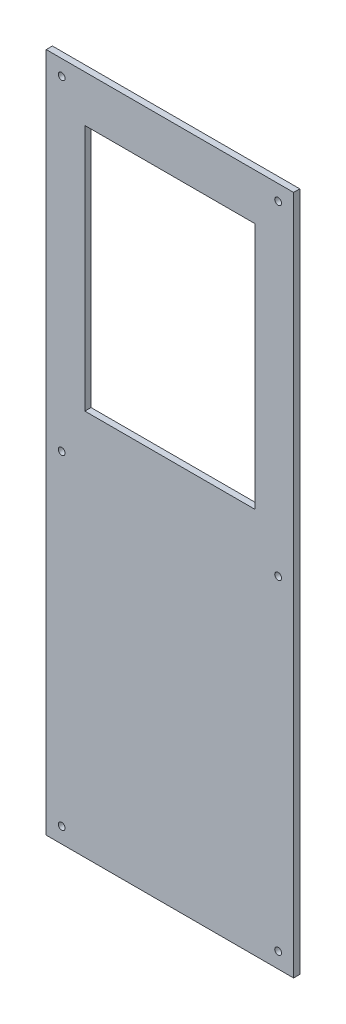
ISO-10303-21;
HEADER;
FILE_DESCRIPTION(('STEP AP214'),'2;1');
FILE_NAME('part.step','',(''),(''),'','','');
FILE_SCHEMA(('AUTOMOTIVE_DESIGN { 1 0 10303 214 1 1 1 1 }'));
ENDSEC;
DATA;
#1=APPLICATION_CONTEXT('core data for automotive mechanical design processes');
#2=APPLICATION_PROTOCOL_DEFINITION('international standard','automotive_design',2000,#1);
#3=PRODUCT_CONTEXT('',#1,'mechanical');
#4=PRODUCT('Part','Part','',(#3));
#5=PRODUCT_RELATED_PRODUCT_CATEGORY('part','',(#4));
#6=PRODUCT_DEFINITION_FORMATION('','',#4);
#7=PRODUCT_DEFINITION_CONTEXT('part definition',#1,'design');
#8=PRODUCT_DEFINITION('design','',#6,#7);
#9=PRODUCT_DEFINITION_SHAPE('','',#8);
#10=(LENGTH_UNIT() NAMED_UNIT(*) SI_UNIT(.MILLI.,.METRE.));
#11=(NAMED_UNIT(*) PLANE_ANGLE_UNIT() SI_UNIT($,.RADIAN.));
#12=(NAMED_UNIT(*) SI_UNIT($,.STERADIAN.) SOLID_ANGLE_UNIT());
#13=UNCERTAINTY_MEASURE_WITH_UNIT(LENGTH_MEASURE(1.E-05),#10,'distance_accuracy_value','');
#14=(GEOMETRIC_REPRESENTATION_CONTEXT(3) GLOBAL_UNCERTAINTY_ASSIGNED_CONTEXT((#13)) GLOBAL_UNIT_ASSIGNED_CONTEXT((#10,
#11,#12)) REPRESENTATION_CONTEXT('',''));
#15=CARTESIAN_POINT('',(0.,0.,0.));
#16=DIRECTION('',(0.,0.,1.));
#17=DIRECTION('',(1.,0.,0.));
#18=AXIS2_PLACEMENT_3D('',#15,#16,#17);
#19=CARTESIAN_POINT('',(0.,0.,4.));
#20=DIRECTION('',(0.,0.,-1.));
#21=DIRECTION('',(-1.,0.,0.));
#22=AXIS2_PLACEMENT_3D('',#19,#20,#21);
#23=PLANE('',#22);
#24=CARTESIAN_POINT('',(-69.9999999999999,-210.,4.));
#25=DIRECTION('',(0.,0.,1.));
#26=DIRECTION('',(-1.,0.,0.));
#27=AXIS2_PLACEMENT_3D('',#24,#25,#26);
#28=CIRCLE('',#27,2.2);
#29=CARTESIAN_POINT('',(-72.1999999999999,-210.,4.));
#30=VERTEX_POINT('',#29);
#31=EDGE_CURVE('E248',#30,#30,#28,.T.);
#32=ORIENTED_EDGE('',*,*,#31,.F.);
#33=EDGE_LOOP('',(#32));
#34=FACE_BOUND('',#33,.T.);
#35=CARTESIAN_POINT('',(-70.,0.,4.));
#36=DIRECTION('',(0.,0.,1.));
#37=DIRECTION('',(-1.,0.,0.));
#38=AXIS2_PLACEMENT_3D('',#35,#36,#37);
#39=CIRCLE('',#38,2.2);
#40=CARTESIAN_POINT('',(-72.1999999999999,0.,4.));
#41=VERTEX_POINT('',#40);
#42=EDGE_CURVE('E247',#41,#41,#39,.T.);
#43=ORIENTED_EDGE('',*,*,#42,.F.);
#44=EDGE_LOOP('',(#43));
#45=FACE_BOUND('',#44,.T.);
#46=CARTESIAN_POINT('',(-70.,210.,4.));
#47=DIRECTION('',(0.,0.,1.));
#48=DIRECTION('',(-1.,0.,0.));
#49=AXIS2_PLACEMENT_3D('',#46,#47,#48);
#50=CIRCLE('',#49,2.2);
#51=CARTESIAN_POINT('',(-72.2,210.,4.));
#52=VERTEX_POINT('',#51);
#53=EDGE_CURVE('E229',#52,#52,#50,.T.);
#54=ORIENTED_EDGE('',*,*,#53,.F.);
#55=EDGE_LOOP('',(#54));
#56=FACE_BOUND('',#55,.T.);
#57=CARTESIAN_POINT('',(70.,-210.,4.));
#58=DIRECTION('',(0.,0.,1.));
#59=DIRECTION('',(1.,0.,0.));
#60=AXIS2_PLACEMENT_3D('',#57,#58,#59);
#61=CIRCLE('',#60,2.2);
#62=CARTESIAN_POINT('',(72.2,-210.,4.));
#63=VERTEX_POINT('',#62);
#64=EDGE_CURVE('E220',#63,#63,#61,.T.);
#65=ORIENTED_EDGE('',*,*,#64,.F.);
#66=EDGE_LOOP('',(#65));
#67=FACE_BOUND('',#66,.T.);
#68=CARTESIAN_POINT('',(70.,210.,4.));
#69=DIRECTION('',(0.,0.,1.));
#70=DIRECTION('',(1.,0.,0.));
#71=AXIS2_PLACEMENT_3D('',#68,#69,#70);
#72=CIRCLE('',#71,2.2);
#73=CARTESIAN_POINT('',(72.2,210.,4.));
#74=VERTEX_POINT('',#73);
#75=EDGE_CURVE('E219',#74,#74,#72,.T.);
#76=ORIENTED_EDGE('',*,*,#75,.F.);
#77=EDGE_LOOP('',(#76));
#78=FACE_BOUND('',#77,.T.);
#79=CARTESIAN_POINT('',(70.,0.,4.));
#80=DIRECTION('',(0.,0.,1.));
#81=DIRECTION('',(1.,0.,0.));
#82=AXIS2_PLACEMENT_3D('',#79,#80,#81);
#83=CIRCLE('',#82,2.2);
#84=CARTESIAN_POINT('',(72.2,0.,4.));
#85=VERTEX_POINT('',#84);
#86=EDGE_CURVE('E159',#85,#85,#83,.T.);
#87=ORIENTED_EDGE('',*,*,#86,.F.);
#88=EDGE_LOOP('',(#87));
#89=FACE_BOUND('',#88,.T.);
#90=DIRECTION('',(0.,-1.,0.));
#91=VECTOR('',#90,1.);
#92=CARTESIAN_POINT('',(-80.,220.,4.));
#93=LINE('',#92,#91);
#94=CARTESIAN_POINT('',(-80.,220.,4.));
#95=VERTEX_POINT('',#94);
#96=CARTESIAN_POINT('',(-79.9999999999999,-220.,4.));
#97=VERTEX_POINT('',#96);
#98=EDGE_CURVE('E168',#95,#97,#93,.T.);
#99=ORIENTED_EDGE('',*,*,#98,.T.);
#100=DIRECTION('',(1.,0.,0.));
#101=VECTOR('',#100,1.);
#102=CARTESIAN_POINT('',(80.,-220.,4.));
#103=LINE('',#102,#101);
#104=CARTESIAN_POINT('',(80.,-220.,4.));
#105=VERTEX_POINT('',#104);
#106=EDGE_CURVE('E199',#97,#105,#103,.T.);
#107=ORIENTED_EDGE('',*,*,#106,.T.);
#108=DIRECTION('',(0.,1.,0.));
#109=VECTOR('',#108,1.);
#110=CARTESIAN_POINT('',(80.,220.,4.));
#111=LINE('',#110,#109);
#112=CARTESIAN_POINT('',(80.,220.,4.));
#113=VERTEX_POINT('',#112);
#114=EDGE_CURVE('E151',#105,#113,#111,.T.);
#115=ORIENTED_EDGE('',*,*,#114,.T.);
#116=DIRECTION('',(-1.,0.,0.));
#117=VECTOR('',#116,1.);
#118=CARTESIAN_POINT('',(80.,220.,4.));
#119=LINE('',#118,#117);
#120=EDGE_CURVE('E146',#113,#95,#119,.T.);
#121=ORIENTED_EDGE('',*,*,#120,.T.);
#122=EDGE_LOOP('',(#99,#107,#115,#121));
#123=FACE_BOUND('',#122,.T.);
#124=DIRECTION('',(0.,1.,0.));
#125=VECTOR('',#124,1.);
#126=CARTESIAN_POINT('',(55.,190.,4.));
#127=LINE('',#126,#125);
#128=CARTESIAN_POINT('',(55.,30.,4.));
#129=VERTEX_POINT('',#128);
#130=CARTESIAN_POINT('',(55.,190.,4.));
#131=VERTEX_POINT('',#130);
#132=EDGE_CURVE('E106',#129,#131,#127,.T.);
#133=ORIENTED_EDGE('',*,*,#132,.F.);
#134=DIRECTION('',(1.,0.,0.));
#135=VECTOR('',#134,1.);
#136=CARTESIAN_POINT('',(-55.,30.,4.));
#137=LINE('',#136,#135);
#138=CARTESIAN_POINT('',(-55.,30.,4.));
#139=VERTEX_POINT('',#138);
#140=EDGE_CURVE('E131',#139,#129,#137,.T.);
#141=ORIENTED_EDGE('',*,*,#140,.F.);
#142=DIRECTION('',(0.,-1.,0.));
#143=VECTOR('',#142,1.);
#144=CARTESIAN_POINT('',(-55.,190.,4.));
#145=LINE('',#144,#143);
#146=CARTESIAN_POINT('',(-55.,190.,4.));
#147=VERTEX_POINT('',#146);
#148=EDGE_CURVE('E128',#147,#139,#145,.T.);
#149=ORIENTED_EDGE('',*,*,#148,.F.);
#150=DIRECTION('',(-1.,0.,0.));
#151=VECTOR('',#150,1.);
#152=CARTESIAN_POINT('',(-55.,190.,4.));
#153=LINE('',#152,#151);
#154=EDGE_CURVE('E115',#131,#147,#153,.T.);
#155=ORIENTED_EDGE('',*,*,#154,.F.);
#156=EDGE_LOOP('',(#133,#141,#149,#155));
#157=FACE_BOUND('',#156,.T.);
#158=ADVANCED_FACE('F40',(#34,#45,#56,#67,#78,#89,#123,#157),#23,.F.);
#159=CARTESIAN_POINT('',(0.,0.,0.));
#160=DIRECTION('',(0.,0.,-1.));
#161=DIRECTION('',(-1.,0.,0.));
#162=AXIS2_PLACEMENT_3D('',#159,#160,#161);
#163=PLANE('',#162);
#164=CARTESIAN_POINT('',(-70.,0.,0.));
#165=DIRECTION('',(0.,0.,1.));
#166=DIRECTION('',(-1.,0.,0.));
#167=AXIS2_PLACEMENT_3D('',#164,#165,#166);
#168=CIRCLE('',#167,2.2);
#169=CARTESIAN_POINT('',(-72.1999999999999,0.,0.));
#170=VERTEX_POINT('',#169);
#171=EDGE_CURVE('E244',#170,#170,#168,.T.);
#172=ORIENTED_EDGE('',*,*,#171,.T.);
#173=EDGE_LOOP('',(#172));
#174=FACE_BOUND('',#173,.T.);
#175=CARTESIAN_POINT('',(70.,-210.,0.));
#176=DIRECTION('',(0.,0.,1.));
#177=DIRECTION('',(1.,0.,0.));
#178=AXIS2_PLACEMENT_3D('',#175,#176,#177);
#179=CIRCLE('',#178,2.2);
#180=CARTESIAN_POINT('',(72.2,-210.,0.));
#181=VERTEX_POINT('',#180);
#182=EDGE_CURVE('E225',#181,#181,#179,.T.);
#183=ORIENTED_EDGE('',*,*,#182,.T.);
#184=EDGE_LOOP('',(#183));
#185=FACE_BOUND('',#184,.T.);
#186=CARTESIAN_POINT('',(70.,0.,0.));
#187=DIRECTION('',(0.,0.,1.));
#188=DIRECTION('',(1.,0.,0.));
#189=AXIS2_PLACEMENT_3D('',#186,#187,#188);
#190=CIRCLE('',#189,2.2);
#191=CARTESIAN_POINT('',(72.2,0.,0.));
#192=VERTEX_POINT('',#191);
#193=EDGE_CURVE('E204',#192,#192,#190,.T.);
#194=ORIENTED_EDGE('',*,*,#193,.T.);
#195=EDGE_LOOP('',(#194));
#196=FACE_BOUND('',#195,.T.);
#197=DIRECTION('',(0.,-1.,0.));
#198=VECTOR('',#197,1.);
#199=CARTESIAN_POINT('',(-80.,220.,0.));
#200=LINE('',#199,#198);
#201=CARTESIAN_POINT('',(-80.,220.,0.));
#202=VERTEX_POINT('',#201);
#203=CARTESIAN_POINT('',(-79.9999999999999,-220.,0.));
#204=VERTEX_POINT('',#203);
#205=EDGE_CURVE('E154',#202,#204,#200,.T.);
#206=ORIENTED_EDGE('',*,*,#205,.F.);
#207=DIRECTION('',(-1.,0.,0.));
#208=VECTOR('',#207,1.);
#209=CARTESIAN_POINT('',(80.,220.,0.));
#210=LINE('',#209,#208);
#211=CARTESIAN_POINT('',(80.,220.,0.));
#212=VERTEX_POINT('',#211);
#213=EDGE_CURVE('E165',#212,#202,#210,.T.);
#214=ORIENTED_EDGE('',*,*,#213,.F.);
#215=DIRECTION('',(0.,1.,0.));
#216=VECTOR('',#215,1.);
#217=CARTESIAN_POINT('',(80.,220.,0.));
#218=LINE('',#217,#216);
#219=CARTESIAN_POINT('',(80.,-220.,0.));
#220=VERTEX_POINT('',#219);
#221=EDGE_CURVE('E162',#220,#212,#218,.T.);
#222=ORIENTED_EDGE('',*,*,#221,.F.);
#223=DIRECTION('',(1.,0.,0.));
#224=VECTOR('',#223,1.);
#225=CARTESIAN_POINT('',(80.,-220.,0.));
#226=LINE('',#225,#224);
#227=EDGE_CURVE('E158',#204,#220,#226,.T.);
#228=ORIENTED_EDGE('',*,*,#227,.F.);
#229=EDGE_LOOP('',(#206,#214,#222,#228));
#230=FACE_BOUND('',#229,.T.);
#231=CARTESIAN_POINT('',(70.,210.,0.));
#232=DIRECTION('',(0.,0.,1.));
#233=DIRECTION('',(1.,0.,0.));
#234=AXIS2_PLACEMENT_3D('',#231,#232,#233);
#235=CIRCLE('',#234,2.2);
#236=CARTESIAN_POINT('',(72.2,210.,0.));
#237=VERTEX_POINT('',#236);
#238=EDGE_CURVE('E216',#237,#237,#235,.T.);
#239=ORIENTED_EDGE('',*,*,#238,.T.);
#240=EDGE_LOOP('',(#239));
#241=FACE_BOUND('',#240,.T.);
#242=CARTESIAN_POINT('',(-70.,210.,0.));
#243=DIRECTION('',(0.,0.,1.));
#244=DIRECTION('',(-1.,0.,0.));
#245=AXIS2_PLACEMENT_3D('',#242,#243,#244);
#246=CIRCLE('',#245,2.2);
#247=CARTESIAN_POINT('',(-72.2,210.,0.));
#248=VERTEX_POINT('',#247);
#249=EDGE_CURVE('E234',#248,#248,#246,.T.);
#250=ORIENTED_EDGE('',*,*,#249,.T.);
#251=EDGE_LOOP('',(#250));
#252=FACE_BOUND('',#251,.T.);
#253=CARTESIAN_POINT('',(-69.9999999999999,-210.,0.));
#254=DIRECTION('',(0.,0.,1.));
#255=DIRECTION('',(-1.,0.,0.));
#256=AXIS2_PLACEMENT_3D('',#253,#254,#255);
#257=CIRCLE('',#256,2.2);
#258=CARTESIAN_POINT('',(-72.1999999999999,-210.,0.));
#259=VERTEX_POINT('',#258);
#260=EDGE_CURVE('E124',#259,#259,#257,.T.);
#261=ORIENTED_EDGE('',*,*,#260,.T.);
#262=EDGE_LOOP('',(#261));
#263=FACE_BOUND('',#262,.T.);
#264=DIRECTION('',(1.,0.,0.));
#265=VECTOR('',#264,1.);
#266=CARTESIAN_POINT('',(-55.,30.,0.));
#267=LINE('',#266,#265);
#268=CARTESIAN_POINT('',(-55.,30.,0.));
#269=VERTEX_POINT('',#268);
#270=CARTESIAN_POINT('',(55.,30.,0.));
#271=VERTEX_POINT('',#270);
#272=EDGE_CURVE('E116',#269,#271,#267,.T.);
#273=ORIENTED_EDGE('',*,*,#272,.T.);
#274=DIRECTION('',(0.,1.,0.));
#275=VECTOR('',#274,1.);
#276=CARTESIAN_POINT('',(55.,190.,0.));
#277=LINE('',#276,#275);
#278=CARTESIAN_POINT('',(55.,190.,0.));
#279=VERTEX_POINT('',#278);
#280=EDGE_CURVE('E64',#271,#279,#277,.T.);
#281=ORIENTED_EDGE('',*,*,#280,.T.);
#282=DIRECTION('',(-1.,0.,0.));
#283=VECTOR('',#282,1.);
#284=CARTESIAN_POINT('',(-55.,190.,0.));
#285=LINE('',#284,#283);
#286=CARTESIAN_POINT('',(-55.,190.,0.));
#287=VERTEX_POINT('',#286);
#288=EDGE_CURVE('E122',#279,#287,#285,.T.);
#289=ORIENTED_EDGE('',*,*,#288,.T.);
#290=DIRECTION('',(0.,-1.,0.));
#291=VECTOR('',#290,1.);
#292=CARTESIAN_POINT('',(-55.,190.,0.));
#293=LINE('',#292,#291);
#294=EDGE_CURVE('E269',#287,#269,#293,.T.);
#295=ORIENTED_EDGE('',*,*,#294,.T.);
#296=EDGE_LOOP('',(#273,#281,#289,#295));
#297=FACE_BOUND('',#296,.T.);
#298=ADVANCED_FACE('F187',(#174,#185,#196,#230,#241,#252,#263,#297),#163,.T.);
#299=CARTESIAN_POINT('',(-80.,220.,4.));
#300=DIRECTION('',(1.,0.,0.));
#301=DIRECTION('',(0.,1.,0.));
#302=AXIS2_PLACEMENT_3D('',#299,#300,#301);
#303=PLANE('',#302);
#304=ORIENTED_EDGE('',*,*,#205,.T.);
#305=DIRECTION('',(0.,0.,-1.));
#306=VECTOR('',#305,1.);
#307=CARTESIAN_POINT('',(-79.9999999999999,-220.,4.));
#308=LINE('',#307,#306);
#309=EDGE_CURVE('E12',#97,#204,#308,.T.);
#310=ORIENTED_EDGE('',*,*,#309,.F.);
#311=ORIENTED_EDGE('',*,*,#98,.F.);
#312=DIRECTION('',(0.,0.,-1.));
#313=VECTOR('',#312,1.);
#314=CARTESIAN_POINT('',(-80.,220.,4.));
#315=LINE('',#314,#313);
#316=EDGE_CURVE('E150',#95,#202,#315,.T.);
#317=ORIENTED_EDGE('',*,*,#316,.T.);
#318=EDGE_LOOP('',(#304,#310,#311,#317));
#319=FACE_BOUND('',#318,.T.);
#320=ADVANCED_FACE('F42',(#319),#303,.F.);
#321=CARTESIAN_POINT('',(80.,-220.,4.));
#322=DIRECTION('',(0.,1.,0.));
#323=DIRECTION('',(0.,0.,1.));
#324=AXIS2_PLACEMENT_3D('',#321,#322,#323);
#325=PLANE('',#324);
#326=ORIENTED_EDGE('',*,*,#227,.T.);
#327=DIRECTION('',(0.,0.,-1.));
#328=VECTOR('',#327,1.);
#329=CARTESIAN_POINT('',(80.,-220.,4.));
#330=LINE('',#329,#328);
#331=EDGE_CURVE('E49',#105,#220,#330,.T.);
#332=ORIENTED_EDGE('',*,*,#331,.F.);
#333=ORIENTED_EDGE('',*,*,#106,.F.);
#334=ORIENTED_EDGE('',*,*,#309,.T.);
#335=EDGE_LOOP('',(#326,#332,#333,#334));
#336=FACE_BOUND('',#335,.T.);
#337=ADVANCED_FACE('F311',(#336),#325,.F.);
#338=CARTESIAN_POINT('',(80.,220.,4.));
#339=DIRECTION('',(-1.,0.,0.));
#340=DIRECTION('',(0.,-1.,0.));
#341=AXIS2_PLACEMENT_3D('',#338,#339,#340);
#342=PLANE('',#341);
#343=ORIENTED_EDGE('',*,*,#221,.T.);
#344=DIRECTION('',(0.,0.,-1.));
#345=VECTOR('',#344,1.);
#346=CARTESIAN_POINT('',(80.,220.,4.));
#347=LINE('',#346,#345);
#348=EDGE_CURVE('E172',#113,#212,#347,.T.);
#349=ORIENTED_EDGE('',*,*,#348,.F.);
#350=ORIENTED_EDGE('',*,*,#114,.F.);
#351=ORIENTED_EDGE('',*,*,#331,.T.);
#352=EDGE_LOOP('',(#343,#349,#350,#351));
#353=FACE_BOUND('',#352,.T.);
#354=ADVANCED_FACE('F181',(#353),#342,.F.);
#355=CARTESIAN_POINT('',(80.,220.,4.));
#356=DIRECTION('',(0.,-1.,0.));
#357=DIRECTION('',(0.,0.,-1.));
#358=AXIS2_PLACEMENT_3D('',#355,#356,#357);
#359=PLANE('',#358);
#360=ORIENTED_EDGE('',*,*,#213,.T.);
#361=ORIENTED_EDGE('',*,*,#316,.F.);
#362=ORIENTED_EDGE('',*,*,#120,.F.);
#363=ORIENTED_EDGE('',*,*,#348,.T.);
#364=EDGE_LOOP('',(#360,#361,#362,#363));
#365=FACE_BOUND('',#364,.T.);
#366=ADVANCED_FACE('F191',(#365),#359,.F.);
#367=CARTESIAN_POINT('',(70.,0.,4.));
#368=DIRECTION('',(0.,0.,-1.));
#369=DIRECTION('',(-1.,0.,0.));
#370=AXIS2_PLACEMENT_3D('',#367,#368,#369);
#371=CYLINDRICAL_SURFACE('',#370,2.2);
#372=ORIENTED_EDGE('',*,*,#86,.T.);
#373=EDGE_LOOP('',(#372));
#374=FACE_BOUND('',#373,.T.);
#375=ORIENTED_EDGE('',*,*,#193,.F.);
#376=EDGE_LOOP('',(#375));
#377=FACE_BOUND('',#376,.T.);
#378=ADVANCED_FACE('F286',(#374,#377),#371,.F.);
#379=CARTESIAN_POINT('',(70.,210.,4.));
#380=DIRECTION('',(0.,0.,-1.));
#381=DIRECTION('',(-1.,0.,0.));
#382=AXIS2_PLACEMENT_3D('',#379,#380,#381);
#383=CYLINDRICAL_SURFACE('',#382,2.2);
#384=ORIENTED_EDGE('',*,*,#75,.T.);
#385=EDGE_LOOP('',(#384));
#386=FACE_BOUND('',#385,.T.);
#387=ORIENTED_EDGE('',*,*,#238,.F.);
#388=EDGE_LOOP('',(#387));
#389=FACE_BOUND('',#388,.T.);
#390=ADVANCED_FACE('F288',(#386,#389),#383,.F.);
#391=CARTESIAN_POINT('',(70.,-210.,4.));
#392=DIRECTION('',(0.,0.,-1.));
#393=DIRECTION('',(-1.,0.,0.));
#394=AXIS2_PLACEMENT_3D('',#391,#392,#393);
#395=CYLINDRICAL_SURFACE('',#394,2.2);
#396=ORIENTED_EDGE('',*,*,#64,.T.);
#397=EDGE_LOOP('',(#396));
#398=FACE_BOUND('',#397,.T.);
#399=ORIENTED_EDGE('',*,*,#182,.F.);
#400=EDGE_LOOP('',(#399));
#401=FACE_BOUND('',#400,.T.);
#402=ADVANCED_FACE('F295',(#398,#401),#395,.F.);
#403=CARTESIAN_POINT('',(-70.,210.,4.));
#404=DIRECTION('',(0.,0.,-1.));
#405=DIRECTION('',(-1.,0.,0.));
#406=AXIS2_PLACEMENT_3D('',#403,#404,#405);
#407=CYLINDRICAL_SURFACE('',#406,2.2);
#408=ORIENTED_EDGE('',*,*,#53,.T.);
#409=EDGE_LOOP('',(#408));
#410=FACE_BOUND('',#409,.T.);
#411=ORIENTED_EDGE('',*,*,#249,.F.);
#412=EDGE_LOOP('',(#411));
#413=FACE_BOUND('',#412,.T.);
#414=ADVANCED_FACE('F362',(#410,#413),#407,.F.);
#415=CARTESIAN_POINT('',(-70.,0.,4.));
#416=DIRECTION('',(0.,0.,-1.));
#417=DIRECTION('',(-1.,0.,0.));
#418=AXIS2_PLACEMENT_3D('',#415,#416,#417);
#419=CYLINDRICAL_SURFACE('',#418,2.2);
#420=ORIENTED_EDGE('',*,*,#42,.T.);
#421=EDGE_LOOP('',(#420));
#422=FACE_BOUND('',#421,.T.);
#423=ORIENTED_EDGE('',*,*,#171,.F.);
#424=EDGE_LOOP('',(#423));
#425=FACE_BOUND('',#424,.T.);
#426=ADVANCED_FACE('F371',(#422,#425),#419,.F.);
#427=CARTESIAN_POINT('',(-69.9999999999999,-210.,4.));
#428=DIRECTION('',(0.,0.,-1.));
#429=DIRECTION('',(-1.,0.,0.));
#430=AXIS2_PLACEMENT_3D('',#427,#428,#429);
#431=CYLINDRICAL_SURFACE('',#430,2.2);
#432=ORIENTED_EDGE('',*,*,#31,.T.);
#433=EDGE_LOOP('',(#432));
#434=FACE_BOUND('',#433,.T.);
#435=ORIENTED_EDGE('',*,*,#260,.F.);
#436=EDGE_LOOP('',(#435));
#437=FACE_BOUND('',#436,.T.);
#438=ADVANCED_FACE('F380',(#434,#437),#431,.F.);
#439=CARTESIAN_POINT('',(55.,190.,4.));
#440=DIRECTION('',(-1.,0.,0.));
#441=DIRECTION('',(0.,-1.,0.));
#442=AXIS2_PLACEMENT_3D('',#439,#440,#441);
#443=PLANE('',#442);
#444=ORIENTED_EDGE('',*,*,#280,.F.);
#445=DIRECTION('',(0.,0.,-1.));
#446=VECTOR('',#445,1.);
#447=CARTESIAN_POINT('',(55.,30.,4.));
#448=LINE('',#447,#446);
#449=EDGE_CURVE('E110',#129,#271,#448,.T.);
#450=ORIENTED_EDGE('',*,*,#449,.F.);
#451=ORIENTED_EDGE('',*,*,#132,.T.);
#452=DIRECTION('',(0.,0.,-1.));
#453=VECTOR('',#452,1.);
#454=CARTESIAN_POINT('',(55.,190.,4.));
#455=LINE('',#454,#453);
#456=EDGE_CURVE('E109',#131,#279,#455,.T.);
#457=ORIENTED_EDGE('',*,*,#456,.T.);
#458=EDGE_LOOP('',(#444,#450,#451,#457));
#459=FACE_BOUND('',#458,.T.);
#460=ADVANCED_FACE('F108',(#459),#443,.T.);
#461=CARTESIAN_POINT('',(-55.,190.,4.));
#462=DIRECTION('',(0.,-1.,0.));
#463=DIRECTION('',(0.,0.,-1.));
#464=AXIS2_PLACEMENT_3D('',#461,#462,#463);
#465=PLANE('',#464);
#466=ORIENTED_EDGE('',*,*,#288,.F.);
#467=ORIENTED_EDGE('',*,*,#456,.F.);
#468=ORIENTED_EDGE('',*,*,#154,.T.);
#469=DIRECTION('',(0.,0.,-1.));
#470=VECTOR('',#469,1.);
#471=CARTESIAN_POINT('',(-55.,190.,4.));
#472=LINE('',#471,#470);
#473=EDGE_CURVE('E125',#147,#287,#472,.T.);
#474=ORIENTED_EDGE('',*,*,#473,.T.);
#475=EDGE_LOOP('',(#466,#467,#468,#474));
#476=FACE_BOUND('',#475,.T.);
#477=ADVANCED_FACE('F119',(#476),#465,.T.);
#478=CARTESIAN_POINT('',(-55.,190.,4.));
#479=DIRECTION('',(1.,0.,0.));
#480=DIRECTION('',(0.,1.,0.));
#481=AXIS2_PLACEMENT_3D('',#478,#479,#480);
#482=PLANE('',#481);
#483=ORIENTED_EDGE('',*,*,#294,.F.);
#484=ORIENTED_EDGE('',*,*,#473,.F.);
#485=ORIENTED_EDGE('',*,*,#148,.T.);
#486=DIRECTION('',(0.,0.,-1.));
#487=VECTOR('',#486,1.);
#488=CARTESIAN_POINT('',(-55.,30.,4.));
#489=LINE('',#488,#487);
#490=EDGE_CURVE('E56',#139,#269,#489,.T.);
#491=ORIENTED_EDGE('',*,*,#490,.T.);
#492=EDGE_LOOP('',(#483,#484,#485,#491));
#493=FACE_BOUND('',#492,.T.);
#494=ADVANCED_FACE('F404',(#493),#482,.T.);
#495=CARTESIAN_POINT('',(-55.,30.,4.));
#496=DIRECTION('',(0.,1.,0.));
#497=DIRECTION('',(0.,0.,1.));
#498=AXIS2_PLACEMENT_3D('',#495,#496,#497);
#499=PLANE('',#498);
#500=ORIENTED_EDGE('',*,*,#272,.F.);
#501=ORIENTED_EDGE('',*,*,#490,.F.);
#502=ORIENTED_EDGE('',*,*,#140,.T.);
#503=ORIENTED_EDGE('',*,*,#449,.T.);
#504=EDGE_LOOP('',(#500,#501,#502,#503));
#505=FACE_BOUND('',#504,.T.);
#506=ADVANCED_FACE('F277',(#505),#499,.T.);
#507=CLOSED_SHELL('',(#158,#298,#320,#337,#354,#366,#378,#390,#402,#414,#426,#438,#460,#477,
#494,#506));
#508=MANIFOLD_SOLID_BREP('B2',#507);
#509=ADVANCED_BREP_SHAPE_REPRESENTATION('',(#18,#508),#14);
#510=SHAPE_DEFINITION_REPRESENTATION(#9,#509);
ENDSEC;
END-ISO-10303-21;
